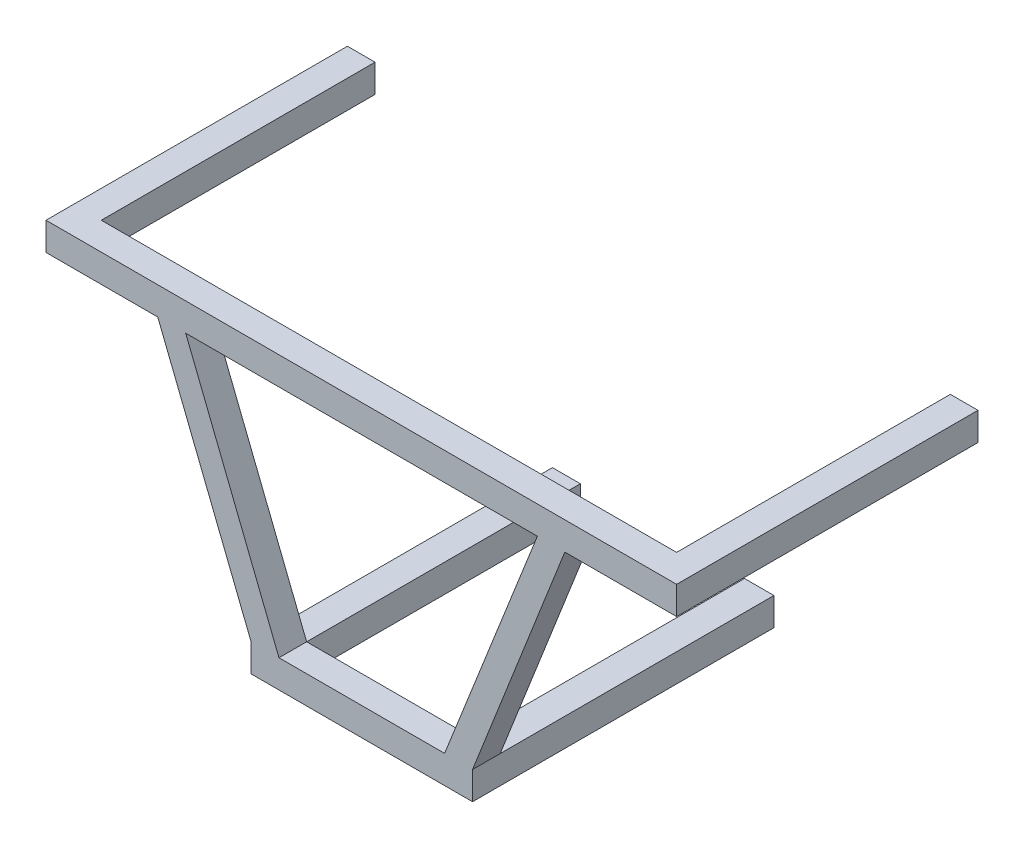
ISO-10303-21;
HEADER;
FILE_DESCRIPTION(('STEP AP214'),'2;1');
FILE_NAME('part.step','',(''),(''),'','','');
FILE_SCHEMA(('AUTOMOTIVE_DESIGN { 1 0 10303 214 1 1 1 1 }'));
ENDSEC;
DATA;
#1=APPLICATION_CONTEXT('core data for automotive mechanical design processes');
#2=APPLICATION_PROTOCOL_DEFINITION('international standard','automotive_design',2000,#1);
#3=PRODUCT_CONTEXT('',#1,'mechanical');
#4=PRODUCT('Part','Part','',(#3));
#5=PRODUCT_RELATED_PRODUCT_CATEGORY('part','',(#4));
#6=PRODUCT_DEFINITION_FORMATION('','',#4);
#7=PRODUCT_DEFINITION_CONTEXT('part definition',#1,'design');
#8=PRODUCT_DEFINITION('design','',#6,#7);
#9=PRODUCT_DEFINITION_SHAPE('','',#8);
#10=(LENGTH_UNIT() NAMED_UNIT(*) SI_UNIT(.MILLI.,.METRE.));
#11=(NAMED_UNIT(*) PLANE_ANGLE_UNIT() SI_UNIT($,.RADIAN.));
#12=(NAMED_UNIT(*) SI_UNIT($,.STERADIAN.) SOLID_ANGLE_UNIT());
#13=UNCERTAINTY_MEASURE_WITH_UNIT(LENGTH_MEASURE(1.E-05),#10,'distance_accuracy_value','');
#14=(GEOMETRIC_REPRESENTATION_CONTEXT(3) GLOBAL_UNCERTAINTY_ASSIGNED_CONTEXT((#13)) GLOBAL_UNIT_ASSIGNED_CONTEXT((#10,
#11,#12)) REPRESENTATION_CONTEXT('',''));
#15=CARTESIAN_POINT('',(0.,0.,0.));
#16=DIRECTION('',(0.,0.,1.));
#17=DIRECTION('',(1.,0.,0.));
#18=AXIS2_PLACEMENT_3D('',#15,#16,#17);
#19=CARTESIAN_POINT('',(1.17087409782305,-164.978418177507,0.));
#20=DIRECTION('',(0.,0.,1.));
#21=DIRECTION('',(1.,0.,0.));
#22=AXIS2_PLACEMENT_3D('',#19,#20,#21);
#23=PLANE('',#22);
#24=DIRECTION('',(1.,0.,0.));
#25=VECTOR('',#24,1.);
#26=CARTESIAN_POINT('',(1.17087409782305,-41.7659648432376,0.));
#27=LINE('',#26,#25);
#28=CARTESIAN_POINT('',(-29.7683982683984,-41.7659648432376,0.));
#29=VERTEX_POINT('',#28);
#30=CARTESIAN_POINT('',(29.588895343738,-41.7659648432376,0.));
#31=VERTEX_POINT('',#30);
#32=EDGE_CURVE('E309',#29,#31,#27,.T.);
#33=ORIENTED_EDGE('',*,*,#32,.T.);
#34=DIRECTION('',(0.,-1.,0.));
#35=VECTOR('',#34,1.);
#36=CARTESIAN_POINT('',(29.588895343738,-164.978418177507,0.));
#37=LINE('',#36,#35);
#38=CARTESIAN_POINT('',(29.588895343738,-51.869178800997,0.));
#39=VERTEX_POINT('',#38);
#40=EDGE_CURVE('E239',#31,#39,#37,.T.);
#41=ORIENTED_EDGE('',*,*,#40,.T.);
#42=DIRECTION('',(1.,0.,0.));
#43=VECTOR('',#42,1.);
#44=CARTESIAN_POINT('',(1.17087409782305,-51.869178800997,0.));
#45=LINE('',#44,#43);
#46=CARTESIAN_POINT('',(-29.7683982683984,-51.869178800997,0.));
#47=VERTEX_POINT('',#46);
#48=EDGE_CURVE('E314',#47,#39,#45,.T.);
#49=ORIENTED_EDGE('',*,*,#48,.F.);
#50=DIRECTION('',(0.,1.,0.));
#51=VECTOR('',#50,1.);
#52=CARTESIAN_POINT('',(-29.7683982683984,-164.978418177507,0.));
#53=LINE('',#52,#51);
#54=EDGE_CURVE('E256',#47,#29,#53,.T.);
#55=ORIENTED_EDGE('',*,*,#54,.T.);
#56=EDGE_LOOP('',(#33,#41,#49,#55));
#57=FACE_BOUND('',#56,.T.);
#58=ADVANCED_FACE('F31',(#57),#23,.F.);
#59=CARTESIAN_POINT('',(1.17087409782305,43.0288665879575,10.));
#60=DIRECTION('',(0.,1.,0.));
#61=DIRECTION('',(0.,0.,1.));
#62=AXIS2_PLACEMENT_3D('',#59,#60,#61);
#63=PLANE('',#62);
#64=DIRECTION('',(1.,0.,0.));
#65=VECTOR('',#64,1.);
#66=CARTESIAN_POINT('',(1.17087409782305,43.0288665879575,0.));
#67=LINE('',#66,#65);
#68=CARTESIAN_POINT('',(-63.5059163059163,43.0288665879575,0.));
#69=VERTEX_POINT('',#68);
#70=CARTESIAN_POINT('',(63.6863308408762,43.0288665879575,0.));
#71=VERTEX_POINT('',#70);
#72=EDGE_CURVE('E339',#69,#71,#67,.T.);
#73=ORIENTED_EDGE('',*,*,#72,.T.);
#74=DIRECTION('',(0.,0.,-1.));
#75=VECTOR('',#74,1.);
#76=CARTESIAN_POINT('',(63.6863308408762,43.0288665879575,10.));
#77=LINE('',#76,#75);
#78=CARTESIAN_POINT('',(63.6863308408762,43.0288665879575,10.));
#79=VERTEX_POINT('',#78);
#80=EDGE_CURVE('E296',#79,#71,#77,.T.);
#81=ORIENTED_EDGE('',*,*,#80,.F.);
#82=DIRECTION('',(1.,0.,0.));
#83=VECTOR('',#82,1.);
#84=CARTESIAN_POINT('',(1.17087409782305,43.0288665879575,10.));
#85=LINE('',#84,#83);
#86=CARTESIAN_POINT('',(-63.5059163059163,43.0288665879575,10.));
#87=VERTEX_POINT('',#86);
#88=EDGE_CURVE('E384',#87,#79,#85,.T.);
#89=ORIENTED_EDGE('',*,*,#88,.F.);
#90=DIRECTION('',(0.,0.,-1.));
#91=VECTOR('',#90,1.);
#92=CARTESIAN_POINT('',(-63.5059163059163,43.0288665879575,10.));
#93=LINE('',#92,#91);
#94=EDGE_CURVE('E358',#87,#69,#93,.T.);
#95=ORIENTED_EDGE('',*,*,#94,.T.);
#96=EDGE_LOOP('',(#73,#81,#89,#95));
#97=FACE_BOUND('',#96,.T.);
#98=ADVANCED_FACE('F415',(#97),#63,.F.);
#99=DIRECTION('',(0.,0.,-1.));
#100=VECTOR('',#99,1.);
#101=CARTESIAN_POINT('',(-73.6091302636757,43.0288665879575,10.));
#102=LINE('',#101,#100);
#103=CARTESIAN_POINT('',(-73.6091302636757,43.0288665879575,10.));
#104=VERTEX_POINT('',#103);
#105=CARTESIAN_POINT('',(-73.6091302636757,43.0288665879575,0.));
#106=VERTEX_POINT('',#105);
#107=EDGE_CURVE('E360',#104,#106,#102,.T.);
#108=ORIENTED_EDGE('',*,*,#107,.F.);
#109=CARTESIAN_POINT('',(-114.021986094713,43.0288665879575,10.));
#110=VERTEX_POINT('',#109);
#111=EDGE_CURVE('E385',#110,#104,#85,.T.);
#112=ORIENTED_EDGE('',*,*,#111,.F.);
#113=DIRECTION('',(0.,0.,-1.));
#114=VECTOR('',#113,1.);
#115=CARTESIAN_POINT('',(-114.021986094713,43.0288665879575,10.));
#116=LINE('',#115,#114);
#117=CARTESIAN_POINT('',(-114.021986094713,43.0288665879575,-99.));
#118=VERTEX_POINT('',#117);
#119=EDGE_CURVE('E390',#110,#118,#116,.T.);
#120=ORIENTED_EDGE('',*,*,#119,.T.);
#121=DIRECTION('',(1.,0.,0.));
#122=VECTOR('',#121,1.);
#123=CARTESIAN_POINT('',(-114.021986094713,43.0288665879575,-99.));
#124=LINE('',#123,#122);
#125=CARTESIAN_POINT('',(-104.023516638141,43.0288665879575,-99.));
#126=VERTEX_POINT('',#125);
#127=EDGE_CURVE('E275',#118,#126,#124,.T.);
#128=ORIENTED_EDGE('',*,*,#127,.T.);
#129=DIRECTION('',(0.,0.,1.));
#130=VECTOR('',#129,1.);
#131=CARTESIAN_POINT('',(-104.023516638141,43.0288665879575,-99.));
#132=LINE('',#131,#130);
#133=CARTESIAN_POINT('',(-104.023516638141,43.0288665879575,0.));
#134=VERTEX_POINT('',#133);
#135=EDGE_CURVE('E284',#126,#134,#132,.T.);
#136=ORIENTED_EDGE('',*,*,#135,.T.);
#137=EDGE_CURVE('E351',#134,#106,#67,.T.);
#138=ORIENTED_EDGE('',*,*,#137,.T.);
#139=EDGE_LOOP('',(#108,#112,#120,#128,#136,#138));
#140=FACE_BOUND('',#139,.T.);
#141=ADVANCED_FACE('F421',(#140),#63,.F.);
#142=CARTESIAN_POINT('',(114.021986094713,-164.978418177507,10.));
#143=DIRECTION('',(1.,0.,0.));
#144=DIRECTION('',(0.,0.,-1.));
#145=AXIS2_PLACEMENT_3D('',#142,#143,#144);
#146=PLANE('',#145);
#147=DIRECTION('',(0.,0.,-1.));
#148=VECTOR('',#147,1.);
#149=CARTESIAN_POINT('',(114.021986094713,43.0288665879575,10.));
#150=LINE('',#149,#148);
#151=CARTESIAN_POINT('',(114.021986094713,43.0288665879575,10.));
#152=VERTEX_POINT('',#151);
#153=CARTESIAN_POINT('',(114.021986094713,43.0288665879575,-99.));
#154=VERTEX_POINT('',#153);
#155=EDGE_CURVE('E204',#152,#154,#150,.T.);
#156=ORIENTED_EDGE('',*,*,#155,.T.);
#157=DIRECTION('',(0.,1.,0.));
#158=VECTOR('',#157,1.);
#159=CARTESIAN_POINT('',(114.021986094713,53.1320805457169,-99.));
#160=LINE('',#159,#158);
#161=CARTESIAN_POINT('',(114.021986094713,53.1320805457169,-99.));
#162=VERTEX_POINT('',#161);
#163=EDGE_CURVE('E198',#154,#162,#160,.T.);
#164=ORIENTED_EDGE('',*,*,#163,.T.);
#165=DIRECTION('',(0.,0.,-1.));
#166=VECTOR('',#165,1.);
#167=CARTESIAN_POINT('',(114.021986094713,53.1320805457169,10.));
#168=LINE('',#167,#166);
#169=CARTESIAN_POINT('',(114.021986094713,53.1320805457169,10.));
#170=VERTEX_POINT('',#169);
#171=EDGE_CURVE('E180',#170,#162,#168,.T.);
#172=ORIENTED_EDGE('',*,*,#171,.F.);
#173=DIRECTION('',(0.,-1.,0.));
#174=VECTOR('',#173,1.);
#175=CARTESIAN_POINT('',(114.021986094713,-164.978418177507,10.));
#176=LINE('',#175,#174);
#177=EDGE_CURVE('E352',#170,#152,#176,.T.);
#178=ORIENTED_EDGE('',*,*,#177,.T.);
#179=EDGE_LOOP('',(#156,#164,#172,#178));
#180=FACE_BOUND('',#179,.T.);
#181=ADVANCED_FACE('F33',(#180),#146,.T.);
#182=CARTESIAN_POINT('',(1.17087409782305,53.1320805457169,10.));
#183=DIRECTION('',(0.,1.,0.));
#184=DIRECTION('',(0.,0.,1.));
#185=AXIS2_PLACEMENT_3D('',#182,#183,#184);
#186=PLANE('',#185);
#187=DIRECTION('',(1.,0.,0.));
#188=VECTOR('',#187,1.);
#189=CARTESIAN_POINT('',(1.17087409782305,53.1320805457169,10.));
#190=LINE('',#189,#188);
#191=CARTESIAN_POINT('',(-114.021986094713,53.1320805457169,10.));
#192=VERTEX_POINT('',#191);
#193=EDGE_CURVE('E186',#192,#170,#190,.T.);
#194=ORIENTED_EDGE('',*,*,#193,.T.);
#195=ORIENTED_EDGE('',*,*,#171,.T.);
#196=DIRECTION('',(-1.,0.,0.));
#197=VECTOR('',#196,1.);
#198=CARTESIAN_POINT('',(114.021986094713,53.1320805457169,-99.));
#199=LINE('',#198,#197);
#200=CARTESIAN_POINT('',(104.023491638141,53.1320805457169,-99.));
#201=VERTEX_POINT('',#200);
#202=EDGE_CURVE('E184',#162,#201,#199,.T.);
#203=ORIENTED_EDGE('',*,*,#202,.T.);
#204=DIRECTION('',(0.,0.,1.));
#205=VECTOR('',#204,1.);
#206=CARTESIAN_POINT('',(104.023491638141,53.1320805457169,-99.));
#207=LINE('',#206,#205);
#208=CARTESIAN_POINT('',(104.023491638141,53.1320805457169,0.));
#209=VERTEX_POINT('',#208);
#210=EDGE_CURVE('E210',#201,#209,#207,.T.);
#211=ORIENTED_EDGE('',*,*,#210,.T.);
#212=DIRECTION('',(1.,0.,0.));
#213=VECTOR('',#212,1.);
#214=CARTESIAN_POINT('',(1.17087409782305,53.1320805457169,0.));
#215=LINE('',#214,#213);
#216=CARTESIAN_POINT('',(-104.023516638141,53.1320805457169,0.));
#217=VERTEX_POINT('',#216);
#218=EDGE_CURVE('E49',#217,#209,#215,.T.);
#219=ORIENTED_EDGE('',*,*,#218,.F.);
#220=DIRECTION('',(0.,0.,1.));
#221=VECTOR('',#220,1.);
#222=CARTESIAN_POINT('',(-104.023516638141,53.1320805457169,-99.));
#223=LINE('',#222,#221);
#224=CARTESIAN_POINT('',(-104.023516638141,53.1320805457169,-99.));
#225=VERTEX_POINT('',#224);
#226=EDGE_CURVE('E285',#225,#217,#223,.T.);
#227=ORIENTED_EDGE('',*,*,#226,.F.);
#228=DIRECTION('',(-1.,0.,0.));
#229=VECTOR('',#228,1.);
#230=CARTESIAN_POINT('',(-114.021986094713,53.1320805457169,-99.));
#231=LINE('',#230,#229);
#232=CARTESIAN_POINT('',(-114.021986094713,53.1320805457169,-99.));
#233=VERTEX_POINT('',#232);
#234=EDGE_CURVE('E281',#225,#233,#231,.T.);
#235=ORIENTED_EDGE('',*,*,#234,.T.);
#236=DIRECTION('',(0.,0.,-1.));
#237=VECTOR('',#236,1.);
#238=CARTESIAN_POINT('',(-114.021986094713,53.1320805457169,10.));
#239=LINE('',#238,#237);
#240=EDGE_CURVE('E191',#192,#233,#239,.T.);
#241=ORIENTED_EDGE('',*,*,#240,.F.);
#242=EDGE_LOOP('',(#194,#195,#203,#211,#219,#227,#235,#241));
#243=FACE_BOUND('',#242,.T.);
#244=ADVANCED_FACE('F182',(#243),#186,.T.);
#245=CARTESIAN_POINT('',(-114.021986094713,-164.978418177507,10.));
#246=DIRECTION('',(1.,0.,0.));
#247=DIRECTION('',(0.,0.,-1.));
#248=AXIS2_PLACEMENT_3D('',#245,#246,#247);
#249=PLANE('',#248);
#250=ORIENTED_EDGE('',*,*,#240,.T.);
#251=DIRECTION('',(0.,-1.,0.));
#252=VECTOR('',#251,1.);
#253=CARTESIAN_POINT('',(-114.021986094713,53.1320805457169,-99.));
#254=LINE('',#253,#252);
#255=EDGE_CURVE('E270',#233,#118,#254,.T.);
#256=ORIENTED_EDGE('',*,*,#255,.T.);
#257=ORIENTED_EDGE('',*,*,#119,.F.);
#258=DIRECTION('',(0.,-1.,0.));
#259=VECTOR('',#258,1.);
#260=CARTESIAN_POINT('',(-114.021986094713,-164.978418177507,10.));
#261=LINE('',#260,#259);
#262=EDGE_CURVE('E379',#192,#110,#261,.T.);
#263=ORIENTED_EDGE('',*,*,#262,.F.);
#264=EDGE_LOOP('',(#250,#256,#257,#263));
#265=FACE_BOUND('',#264,.T.);
#266=ADVANCED_FACE('F436',(#265),#249,.F.);
#267=CARTESIAN_POINT('',(73.6091302636757,43.0288665879575,0.));
#268=VERTEX_POINT('',#267);
#269=CARTESIAN_POINT('',(104.023491638141,43.0288665879575,0.));
#270=VERTEX_POINT('',#269);
#271=EDGE_CURVE('E336',#268,#270,#67,.T.);
#272=ORIENTED_EDGE('',*,*,#271,.T.);
#273=DIRECTION('',(0.,0.,1.));
#274=VECTOR('',#273,1.);
#275=CARTESIAN_POINT('',(104.023491638141,43.0288665879575,-99.));
#276=LINE('',#275,#274);
#277=CARTESIAN_POINT('',(104.023491638141,43.0288665879575,-99.));
#278=VERTEX_POINT('',#277);
#279=EDGE_CURVE('E211',#278,#270,#276,.T.);
#280=ORIENTED_EDGE('',*,*,#279,.F.);
#281=DIRECTION('',(1.,0.,0.));
#282=VECTOR('',#281,1.);
#283=CARTESIAN_POINT('',(114.021986094713,43.0288665879575,-99.));
#284=LINE('',#283,#282);
#285=EDGE_CURVE('E208',#278,#154,#284,.T.);
#286=ORIENTED_EDGE('',*,*,#285,.T.);
#287=ORIENTED_EDGE('',*,*,#155,.F.);
#288=CARTESIAN_POINT('',(73.6091302636757,43.0288665879575,10.));
#289=VERTEX_POINT('',#288);
#290=EDGE_CURVE('E340',#289,#152,#85,.T.);
#291=ORIENTED_EDGE('',*,*,#290,.F.);
#292=DIRECTION('',(0.,0.,-1.));
#293=VECTOR('',#292,1.);
#294=CARTESIAN_POINT('',(73.6091302636757,43.0288665879575,10.));
#295=LINE('',#294,#293);
#296=EDGE_CURVE('E303',#289,#268,#295,.T.);
#297=ORIENTED_EDGE('',*,*,#296,.T.);
#298=EDGE_LOOP('',(#272,#280,#286,#287,#291,#297));
#299=FACE_BOUND('',#298,.T.);
#300=ADVANCED_FACE('F400',(#299),#63,.F.);
#301=CARTESIAN_POINT('',(1.17087409782305,-164.978418177507,10.));
#302=DIRECTION('',(0.,0.,1.));
#303=DIRECTION('',(1.,0.,0.));
#304=AXIS2_PLACEMENT_3D('',#301,#302,#303);
#305=PLANE('',#304);
#306=ORIENTED_EDGE('',*,*,#290,.T.);
#307=ORIENTED_EDGE('',*,*,#177,.F.);
#308=ORIENTED_EDGE('',*,*,#193,.F.);
#309=ORIENTED_EDGE('',*,*,#262,.T.);
#310=ORIENTED_EDGE('',*,*,#111,.T.);
#311=DIRECTION('',(-0.36968580121388,0.929156826580342,0.));
#312=VECTOR('',#311,1.);
#313=CARTESIAN_POINT('',(8.06056098674495,-162.237202330212,10.));
#314=LINE('',#313,#312);
#315=CARTESIAN_POINT('',(-39.8716122261577,-41.7659648432376,10.));
#316=VERTEX_POINT('',#315);
#317=EDGE_CURVE('E333',#316,#104,#314,.T.);
#318=ORIENTED_EDGE('',*,*,#317,.F.);
#319=DIRECTION('',(0.,-1.,0.));
#320=VECTOR('',#319,1.);
#321=CARTESIAN_POINT('',(-39.8716122261577,-164.978418177507,10.));
#322=LINE('',#321,#320);
#323=CARTESIAN_POINT('',(-39.8716122261577,-51.869178800997,10.));
#324=VERTEX_POINT('',#323);
#325=EDGE_CURVE('E317',#316,#324,#322,.T.);
#326=ORIENTED_EDGE('',*,*,#325,.T.);
#327=DIRECTION('',(1.,0.,0.));
#328=VECTOR('',#327,1.);
#329=CARTESIAN_POINT('',(1.17087409782305,-51.869178800997,10.));
#330=LINE('',#329,#328);
#331=CARTESIAN_POINT('',(40.2324412960777,-51.869178800997,10.));
#332=VERTEX_POINT('',#331);
#333=EDGE_CURVE('E501',#324,#332,#330,.T.);
#334=ORIENTED_EDGE('',*,*,#333,.T.);
#335=DIRECTION('',(0.,-1.,0.));
#336=VECTOR('',#335,1.);
#337=CARTESIAN_POINT('',(40.2324412960777,-164.978418177507,10.));
#338=LINE('',#337,#336);
#339=CARTESIAN_POINT('',(40.2324412960777,-41.7659648432376,10.));
#340=VERTEX_POINT('',#339);
#341=EDGE_CURVE('E310',#340,#332,#338,.T.);
#342=ORIENTED_EDGE('',*,*,#341,.F.);
#343=DIRECTION('',(-0.366264831108058,-0.930510652004256,0.));
#344=VECTOR('',#343,1.);
#345=CARTESIAN_POINT('',(-7.00011119691586,-161.762179284897,10.));
#346=LINE('',#345,#344);
#347=EDGE_CURVE('E292',#289,#340,#346,.T.);
#348=ORIENTED_EDGE('',*,*,#347,.F.);
#349=EDGE_LOOP('',(#306,#307,#308,#309,#310,#318,#326,#334,#342,#348));
#350=FACE_BOUND('',#349,.T.);
#351=DIRECTION('',(0.36797718399465,0.92983481977143,0.));
#352=VECTOR('',#351,1.);
#353=CARTESIAN_POINT('',(-15.9500688510154,-158.202896074349,10.));
#354=LINE('',#353,#352);
#355=CARTESIAN_POINT('',(30.1292273383182,-41.7659648432376,10.));
#356=VERTEX_POINT('',#355);
#357=EDGE_CURVE('E289',#356,#79,#354,.T.);
#358=ORIENTED_EDGE('',*,*,#357,.F.);
#359=DIRECTION('',(1.,0.,0.));
#360=VECTOR('',#359,1.);
#361=CARTESIAN_POINT('',(1.17087409782305,-41.7659648432376,10.));
#362=LINE('',#361,#360);
#363=CARTESIAN_POINT('',(-29.7683982683984,-41.7659648432376,10.));
#364=VERTEX_POINT('',#363);
#365=EDGE_CURVE('E313',#364,#356,#362,.T.);
#366=ORIENTED_EDGE('',*,*,#365,.F.);
#367=DIRECTION('',(0.36968580121388,-0.929156826580342,0.));
#368=VECTOR('',#367,1.);
#369=CARTESIAN_POINT('',(16.7829930252843,-158.766787880836,10.));
#370=LINE('',#369,#368);
#371=EDGE_CURVE('E372',#87,#364,#370,.T.);
#372=ORIENTED_EDGE('',*,*,#371,.F.);
#373=ORIENTED_EDGE('',*,*,#88,.T.);
#374=EDGE_LOOP('',(#358,#366,#372,#373));
#375=FACE_BOUND('',#374,.T.);
#376=ADVANCED_FACE('F396',(#350,#375),#305,.T.);
#377=ORIENTED_EDGE('',*,*,#218,.T.);
#378=DIRECTION('',(0.,-1.,0.));
#379=VECTOR('',#378,1.);
#380=CARTESIAN_POINT('',(104.023491638141,-164.978418177507,0.));
#381=LINE('',#380,#379);
#382=EDGE_CURVE('E11',#209,#270,#381,.T.);
#383=ORIENTED_EDGE('',*,*,#382,.T.);
#384=ORIENTED_EDGE('',*,*,#271,.F.);
#385=DIRECTION('',(-0.366264831108058,-0.930510652004256,0.));
#386=VECTOR('',#385,1.);
#387=CARTESIAN_POINT('',(-7.00011119691586,-161.762179284897,0.));
#388=LINE('',#387,#386);
#389=CARTESIAN_POINT('',(40.2324412960777,-41.7659648432376,0.));
#390=VERTEX_POINT('',#389);
#391=EDGE_CURVE('E293',#268,#390,#388,.T.);
#392=ORIENTED_EDGE('',*,*,#391,.T.);
#393=DIRECTION('',(-1.,0.,0.));
#394=VECTOR('',#393,1.);
#395=CARTESIAN_POINT('',(1.17087409782305,-41.7659648432376,0.));
#396=LINE('',#395,#394);
#397=CARTESIAN_POINT('',(30.1292273383182,-41.7659648432376,0.));
#398=VERTEX_POINT('',#397);
#399=EDGE_CURVE('E231',#390,#398,#396,.T.);
#400=ORIENTED_EDGE('',*,*,#399,.T.);
#401=DIRECTION('',(0.36797718399465,0.92983481977143,0.));
#402=VECTOR('',#401,1.);
#403=CARTESIAN_POINT('',(-15.9500688510154,-158.202896074349,0.));
#404=LINE('',#403,#402);
#405=EDGE_CURVE('E287',#398,#71,#404,.T.);
#406=ORIENTED_EDGE('',*,*,#405,.T.);
#407=ORIENTED_EDGE('',*,*,#72,.F.);
#408=DIRECTION('',(0.36968580121388,-0.929156826580342,0.));
#409=VECTOR('',#408,1.);
#410=CARTESIAN_POINT('',(16.7829930252843,-158.766787880836,0.));
#411=LINE('',#410,#409);
#412=EDGE_CURVE('E506',#69,#29,#411,.T.);
#413=ORIENTED_EDGE('',*,*,#412,.T.);
#414=DIRECTION('',(-1.,0.,0.));
#415=VECTOR('',#414,1.);
#416=CARTESIAN_POINT('',(1.17087409782305,-41.7659648432376,0.));
#417=LINE('',#416,#415);
#418=CARTESIAN_POINT('',(-39.8716122261577,-41.7659648432376,0.));
#419=VERTEX_POINT('',#418);
#420=EDGE_CURVE('E265',#29,#419,#417,.T.);
#421=ORIENTED_EDGE('',*,*,#420,.T.);
#422=DIRECTION('',(-0.36968580121388,0.929156826580342,0.));
#423=VECTOR('',#422,1.);
#424=CARTESIAN_POINT('',(8.06056098674495,-162.237202330212,0.));
#425=LINE('',#424,#423);
#426=EDGE_CURVE('E509',#419,#106,#425,.T.);
#427=ORIENTED_EDGE('',*,*,#426,.T.);
#428=ORIENTED_EDGE('',*,*,#137,.F.);
#429=DIRECTION('',(0.,1.,0.));
#430=VECTOR('',#429,1.);
#431=CARTESIAN_POINT('',(-104.023516638141,-164.978418177507,0.));
#432=LINE('',#431,#430);
#433=EDGE_CURVE('E39',#134,#217,#432,.T.);
#434=ORIENTED_EDGE('',*,*,#433,.T.);
#435=EDGE_LOOP('',(#377,#383,#384,#392,#400,#406,#407,#413,#421,#427,#428,#434));
#436=FACE_BOUND('',#435,.T.);
#437=ADVANCED_FACE('F355',(#436),#23,.F.);
#438=CARTESIAN_POINT('',(16.7829930252843,-158.766787880836,10.));
#439=DIRECTION('',(0.929156826580342,0.36968580121388,0.));
#440=DIRECTION('',(-0.36968580121388,0.929156826580342,0.));
#441=AXIS2_PLACEMENT_3D('',#438,#439,#440);
#442=PLANE('',#441);
#443=ORIENTED_EDGE('',*,*,#412,.F.);
#444=ORIENTED_EDGE('',*,*,#94,.F.);
#445=ORIENTED_EDGE('',*,*,#371,.T.);
#446=DIRECTION('',(0.,0.,-1.));
#447=VECTOR('',#446,1.);
#448=CARTESIAN_POINT('',(-29.7683982683984,-41.7659648432376,10.));
#449=LINE('',#448,#447);
#450=EDGE_CURVE('E329',#364,#29,#449,.T.);
#451=ORIENTED_EDGE('',*,*,#450,.T.);
#452=EDGE_LOOP('',(#443,#444,#445,#451));
#453=FACE_BOUND('',#452,.T.);
#454=ADVANCED_FACE('F425',(#453),#442,.T.);
#455=CARTESIAN_POINT('',(8.06056098674495,-162.237202330212,10.));
#456=DIRECTION('',(-0.929156826580342,-0.36968580121388,0.));
#457=DIRECTION('',(0.36968580121388,-0.929156826580342,0.));
#458=AXIS2_PLACEMENT_3D('',#455,#456,#457);
#459=PLANE('',#458);
#460=ORIENTED_EDGE('',*,*,#426,.F.);
#461=DIRECTION('',(0.,0.,-1.));
#462=VECTOR('',#461,1.);
#463=CARTESIAN_POINT('',(-39.8716122261577,-41.7659648432376,10.));
#464=LINE('',#463,#462);
#465=EDGE_CURVE('E326',#316,#419,#464,.T.);
#466=ORIENTED_EDGE('',*,*,#465,.F.);
#467=ORIENTED_EDGE('',*,*,#317,.T.);
#468=ORIENTED_EDGE('',*,*,#107,.T.);
#469=EDGE_LOOP('',(#460,#466,#467,#468));
#470=FACE_BOUND('',#469,.T.);
#471=ADVANCED_FACE('F430',(#470),#459,.T.);
#472=CARTESIAN_POINT('',(1.17087409782305,-41.7659648432376,10.));
#473=DIRECTION('',(0.,1.,0.));
#474=DIRECTION('',(0.,0.,1.));
#475=AXIS2_PLACEMENT_3D('',#472,#473,#474);
#476=PLANE('',#475);
#477=ORIENTED_EDGE('',*,*,#365,.T.);
#478=DIRECTION('',(0.,0.,-1.));
#479=VECTOR('',#478,1.);
#480=CARTESIAN_POINT('',(30.1292273383182,-41.7659648432376,10.));
#481=LINE('',#480,#479);
#482=EDGE_CURVE('E306',#356,#398,#481,.T.);
#483=ORIENTED_EDGE('',*,*,#482,.T.);
#484=ORIENTED_EDGE('',*,*,#399,.F.);
#485=DIRECTION('',(0.,0.,1.));
#486=VECTOR('',#485,1.);
#487=CARTESIAN_POINT('',(40.2324412960777,-41.7659648432376,-99.));
#488=LINE('',#487,#486);
#489=CARTESIAN_POINT('',(40.2324412960777,-41.7659648432376,-99.));
#490=VERTEX_POINT('',#489);
#491=EDGE_CURVE('E227',#490,#390,#488,.T.);
#492=ORIENTED_EDGE('',*,*,#491,.F.);
#493=DIRECTION('',(-1.,0.,0.));
#494=VECTOR('',#493,1.);
#495=CARTESIAN_POINT('',(40.2324412960777,-41.7659648432376,-99.));
#496=LINE('',#495,#494);
#497=CARTESIAN_POINT('',(29.588895343738,-41.7659648432376,-99.));
#498=VERTEX_POINT('',#497);
#499=EDGE_CURVE('E218',#490,#498,#496,.T.);
#500=ORIENTED_EDGE('',*,*,#499,.T.);
#501=DIRECTION('',(0.,0.,1.));
#502=VECTOR('',#501,1.);
#503=CARTESIAN_POINT('',(29.588895343738,-41.7659648432376,-99.));
#504=LINE('',#503,#502);
#505=EDGE_CURVE('E232',#498,#31,#504,.T.);
#506=ORIENTED_EDGE('',*,*,#505,.T.);
#507=ORIENTED_EDGE('',*,*,#32,.F.);
#508=ORIENTED_EDGE('',*,*,#450,.F.);
#509=EDGE_LOOP('',(#477,#483,#484,#492,#500,#506,#507,#508));
#510=FACE_BOUND('',#509,.T.);
#511=ADVANCED_FACE('F440',(#510),#476,.T.);
#512=CARTESIAN_POINT('',(40.2324412960777,-164.978418177507,10.));
#513=DIRECTION('',(1.,0.,0.));
#514=DIRECTION('',(0.,0.,-1.));
#515=AXIS2_PLACEMENT_3D('',#512,#513,#514);
#516=PLANE('',#515);
#517=DIRECTION('',(0.,0.,-1.));
#518=VECTOR('',#517,1.);
#519=CARTESIAN_POINT('',(40.2324412960777,-51.869178800997,10.));
#520=LINE('',#519,#518);
#521=CARTESIAN_POINT('',(40.2324412960777,-51.869178800997,-99.));
#522=VERTEX_POINT('',#521);
#523=EDGE_CURVE('E498',#332,#522,#520,.T.);
#524=ORIENTED_EDGE('',*,*,#523,.T.);
#525=DIRECTION('',(0.,1.,0.));
#526=VECTOR('',#525,1.);
#527=CARTESIAN_POINT('',(40.2324412960777,-41.7659648432376,-99.));
#528=LINE('',#527,#526);
#529=EDGE_CURVE('E214',#522,#490,#528,.T.);
#530=ORIENTED_EDGE('',*,*,#529,.T.);
#531=ORIENTED_EDGE('',*,*,#491,.T.);
#532=DIRECTION('',(0.,0.,-1.));
#533=VECTOR('',#532,1.);
#534=CARTESIAN_POINT('',(40.2324412960777,-41.7659648432376,10.));
#535=LINE('',#534,#533);
#536=EDGE_CURVE('E503',#340,#390,#535,.T.);
#537=ORIENTED_EDGE('',*,*,#536,.F.);
#538=ORIENTED_EDGE('',*,*,#341,.T.);
#539=EDGE_LOOP('',(#524,#530,#531,#537,#538));
#540=FACE_BOUND('',#539,.T.);
#541=ADVANCED_FACE('F442',(#540),#516,.T.);
#542=CARTESIAN_POINT('',(-39.8716122261577,-164.978418177507,10.));
#543=DIRECTION('',(1.,0.,0.));
#544=DIRECTION('',(0.,0.,-1.));
#545=AXIS2_PLACEMENT_3D('',#542,#543,#544);
#546=PLANE('',#545);
#547=ORIENTED_EDGE('',*,*,#465,.T.);
#548=DIRECTION('',(0.,0.,1.));
#549=VECTOR('',#548,1.);
#550=CARTESIAN_POINT('',(-39.8716122261577,-41.7659648432376,-99.));
#551=LINE('',#550,#549);
#552=CARTESIAN_POINT('',(-39.8716122261577,-41.7659648432376,-99.));
#553=VERTEX_POINT('',#552);
#554=EDGE_CURVE('E254',#553,#419,#551,.T.);
#555=ORIENTED_EDGE('',*,*,#554,.F.);
#556=DIRECTION('',(0.,-1.,0.));
#557=VECTOR('',#556,1.);
#558=CARTESIAN_POINT('',(-39.8716122261577,-41.7659648432376,-99.));
#559=LINE('',#558,#557);
#560=CARTESIAN_POINT('',(-39.8716122261577,-51.869178800997,-99.));
#561=VERTEX_POINT('',#560);
#562=EDGE_CURVE('E241',#553,#561,#559,.T.);
#563=ORIENTED_EDGE('',*,*,#562,.T.);
#564=DIRECTION('',(0.,0.,-1.));
#565=VECTOR('',#564,1.);
#566=CARTESIAN_POINT('',(-39.8716122261577,-51.869178800997,10.));
#567=LINE('',#566,#565);
#568=EDGE_CURVE('E500',#324,#561,#567,.T.);
#569=ORIENTED_EDGE('',*,*,#568,.F.);
#570=ORIENTED_EDGE('',*,*,#325,.F.);
#571=EDGE_LOOP('',(#547,#555,#563,#569,#570));
#572=FACE_BOUND('',#571,.T.);
#573=ADVANCED_FACE('F445',(#572),#546,.F.);
#574=CARTESIAN_POINT('',(1.17087409782305,-51.869178800997,10.));
#575=DIRECTION('',(0.,1.,0.));
#576=DIRECTION('',(0.,0.,1.));
#577=AXIS2_PLACEMENT_3D('',#574,#575,#576);
#578=PLANE('',#577);
#579=ORIENTED_EDGE('',*,*,#48,.T.);
#580=DIRECTION('',(0.,0.,1.));
#581=VECTOR('',#580,1.);
#582=CARTESIAN_POINT('',(29.588895343738,-51.869178800997,-99.));
#583=LINE('',#582,#581);
#584=CARTESIAN_POINT('',(29.588895343738,-51.869178800997,-99.));
#585=VERTEX_POINT('',#584);
#586=EDGE_CURVE('E228',#585,#39,#583,.T.);
#587=ORIENTED_EDGE('',*,*,#586,.F.);
#588=DIRECTION('',(1.,0.,0.));
#589=VECTOR('',#588,1.);
#590=CARTESIAN_POINT('',(40.2324412960777,-51.869178800997,-99.));
#591=LINE('',#590,#589);
#592=EDGE_CURVE('E224',#585,#522,#591,.T.);
#593=ORIENTED_EDGE('',*,*,#592,.T.);
#594=ORIENTED_EDGE('',*,*,#523,.F.);
#595=ORIENTED_EDGE('',*,*,#333,.F.);
#596=ORIENTED_EDGE('',*,*,#568,.T.);
#597=DIRECTION('',(1.,0.,0.));
#598=VECTOR('',#597,1.);
#599=CARTESIAN_POINT('',(-39.8716122261577,-51.869178800997,-99.));
#600=LINE('',#599,#598);
#601=CARTESIAN_POINT('',(-29.7683982683984,-51.869178800997,-99.));
#602=VERTEX_POINT('',#601);
#603=EDGE_CURVE('E244',#561,#602,#600,.T.);
#604=ORIENTED_EDGE('',*,*,#603,.T.);
#605=DIRECTION('',(0.,0.,1.));
#606=VECTOR('',#605,1.);
#607=CARTESIAN_POINT('',(-29.7683982683984,-51.869178800997,-99.));
#608=LINE('',#607,#606);
#609=EDGE_CURVE('E253',#602,#47,#608,.T.);
#610=ORIENTED_EDGE('',*,*,#609,.T.);
#611=EDGE_LOOP('',(#579,#587,#593,#594,#595,#596,#604,#610));
#612=FACE_BOUND('',#611,.T.);
#613=ADVANCED_FACE('F452',(#612),#578,.F.);
#614=CARTESIAN_POINT('',(-15.9500688510154,-158.202896074349,10.));
#615=DIRECTION('',(-0.92983481977143,0.36797718399465,0.));
#616=DIRECTION('',(-0.36797718399465,-0.92983481977143,0.));
#617=AXIS2_PLACEMENT_3D('',#614,#615,#616);
#618=PLANE('',#617);
#619=ORIENTED_EDGE('',*,*,#405,.F.);
#620=ORIENTED_EDGE('',*,*,#482,.F.);
#621=ORIENTED_EDGE('',*,*,#357,.T.);
#622=ORIENTED_EDGE('',*,*,#80,.T.);
#623=EDGE_LOOP('',(#619,#620,#621,#622));
#624=FACE_BOUND('',#623,.T.);
#625=ADVANCED_FACE('F456',(#624),#618,.T.);
#626=CARTESIAN_POINT('',(-7.00011119691586,-161.762179284897,10.));
#627=DIRECTION('',(0.930510652004256,-0.366264831108058,0.));
#628=DIRECTION('',(0.366264831108058,0.930510652004256,0.));
#629=AXIS2_PLACEMENT_3D('',#626,#627,#628);
#630=PLANE('',#629);
#631=ORIENTED_EDGE('',*,*,#391,.F.);
#632=ORIENTED_EDGE('',*,*,#296,.F.);
#633=ORIENTED_EDGE('',*,*,#347,.T.);
#634=ORIENTED_EDGE('',*,*,#536,.T.);
#635=EDGE_LOOP('',(#631,#632,#633,#634));
#636=FACE_BOUND('',#635,.T.);
#637=ADVANCED_FACE('F460',(#636),#630,.T.);
#638=CARTESIAN_POINT('',(-104.023516638141,53.1320805457169,-99.));
#639=DIRECTION('',(1.,0.,0.));
#640=DIRECTION('',(0.,0.,-1.));
#641=AXIS2_PLACEMENT_3D('',#638,#639,#640);
#642=PLANE('',#641);
#643=ORIENTED_EDGE('',*,*,#433,.F.);
#644=ORIENTED_EDGE('',*,*,#135,.F.);
#645=DIRECTION('',(0.,1.,0.));
#646=VECTOR('',#645,1.);
#647=CARTESIAN_POINT('',(-104.023516638141,53.1320805457169,-99.));
#648=LINE('',#647,#646);
#649=EDGE_CURVE('E278',#126,#225,#648,.T.);
#650=ORIENTED_EDGE('',*,*,#649,.T.);
#651=ORIENTED_EDGE('',*,*,#226,.T.);
#652=EDGE_LOOP('',(#643,#644,#650,#651));
#653=FACE_BOUND('',#652,.T.);
#654=ADVANCED_FACE('F464',(#653),#642,.T.);
#655=CARTESIAN_POINT('',(-114.021986094713,43.0288665879575,-99.));
#656=DIRECTION('',(0.,0.,1.));
#657=DIRECTION('',(1.,0.,0.));
#658=AXIS2_PLACEMENT_3D('',#655,#656,#657);
#659=PLANE('',#658);
#660=ORIENTED_EDGE('',*,*,#255,.F.);
#661=ORIENTED_EDGE('',*,*,#234,.F.);
#662=ORIENTED_EDGE('',*,*,#649,.F.);
#663=ORIENTED_EDGE('',*,*,#127,.F.);
#664=EDGE_LOOP('',(#660,#661,#662,#663));
#665=FACE_BOUND('',#664,.T.);
#666=ADVANCED_FACE('F468',(#665),#659,.F.);
#667=CARTESIAN_POINT('',(-39.8716122261577,-41.7659648432376,-99.));
#668=DIRECTION('',(0.,1.,0.));
#669=DIRECTION('',(0.,0.,1.));
#670=AXIS2_PLACEMENT_3D('',#667,#668,#669);
#671=PLANE('',#670);
#672=ORIENTED_EDGE('',*,*,#420,.F.);
#673=DIRECTION('',(0.,0.,1.));
#674=VECTOR('',#673,1.);
#675=CARTESIAN_POINT('',(-29.7683982683984,-41.7659648432376,-99.));
#676=LINE('',#675,#674);
#677=CARTESIAN_POINT('',(-29.7683982683984,-41.7659648432376,-99.));
#678=VERTEX_POINT('',#677);
#679=EDGE_CURVE('E257',#678,#29,#676,.T.);
#680=ORIENTED_EDGE('',*,*,#679,.F.);
#681=DIRECTION('',(-1.,0.,0.));
#682=VECTOR('',#681,1.);
#683=CARTESIAN_POINT('',(-39.8716122261577,-41.7659648432376,-99.));
#684=LINE('',#683,#682);
#685=EDGE_CURVE('E250',#678,#553,#684,.T.);
#686=ORIENTED_EDGE('',*,*,#685,.T.);
#687=ORIENTED_EDGE('',*,*,#554,.T.);
#688=EDGE_LOOP('',(#672,#680,#686,#687));
#689=FACE_BOUND('',#688,.T.);
#690=ADVANCED_FACE('F471',(#689),#671,.T.);
#691=CARTESIAN_POINT('',(-29.7683982683984,-41.7659648432376,-99.));
#692=DIRECTION('',(1.,0.,0.));
#693=DIRECTION('',(0.,0.,-1.));
#694=AXIS2_PLACEMENT_3D('',#691,#692,#693);
#695=PLANE('',#694);
#696=ORIENTED_EDGE('',*,*,#54,.F.);
#697=ORIENTED_EDGE('',*,*,#609,.F.);
#698=DIRECTION('',(0.,1.,0.));
#699=VECTOR('',#698,1.);
#700=CARTESIAN_POINT('',(-29.7683982683984,-41.7659648432376,-99.));
#701=LINE('',#700,#699);
#702=EDGE_CURVE('E247',#602,#678,#701,.T.);
#703=ORIENTED_EDGE('',*,*,#702,.T.);
#704=ORIENTED_EDGE('',*,*,#679,.T.);
#705=EDGE_LOOP('',(#696,#697,#703,#704));
#706=FACE_BOUND('',#705,.T.);
#707=ADVANCED_FACE('F473',(#706),#695,.T.);
#708=CARTESIAN_POINT('',(-39.8716122261577,-51.869178800997,-99.));
#709=DIRECTION('',(0.,0.,1.));
#710=DIRECTION('',(1.,0.,0.));
#711=AXIS2_PLACEMENT_3D('',#708,#709,#710);
#712=PLANE('',#711);
#713=ORIENTED_EDGE('',*,*,#562,.F.);
#714=ORIENTED_EDGE('',*,*,#685,.F.);
#715=ORIENTED_EDGE('',*,*,#702,.F.);
#716=ORIENTED_EDGE('',*,*,#603,.F.);
#717=EDGE_LOOP('',(#713,#714,#715,#716));
#718=FACE_BOUND('',#717,.T.);
#719=ADVANCED_FACE('F476',(#718),#712,.F.);
#720=CARTESIAN_POINT('',(29.588895343738,-41.7659648432376,-99.));
#721=DIRECTION('',(-1.,0.,0.));
#722=DIRECTION('',(0.,0.,1.));
#723=AXIS2_PLACEMENT_3D('',#720,#721,#722);
#724=PLANE('',#723);
#725=ORIENTED_EDGE('',*,*,#40,.F.);
#726=ORIENTED_EDGE('',*,*,#505,.F.);
#727=DIRECTION('',(0.,-1.,0.));
#728=VECTOR('',#727,1.);
#729=CARTESIAN_POINT('',(29.588895343738,-41.7659648432376,-99.));
#730=LINE('',#729,#728);
#731=EDGE_CURVE('E221',#498,#585,#730,.T.);
#732=ORIENTED_EDGE('',*,*,#731,.T.);
#733=ORIENTED_EDGE('',*,*,#586,.T.);
#734=EDGE_LOOP('',(#725,#726,#732,#733));
#735=FACE_BOUND('',#734,.T.);
#736=ADVANCED_FACE('F411',(#735),#724,.T.);
#737=CARTESIAN_POINT('',(40.2324412960777,-51.869178800997,-99.));
#738=DIRECTION('',(0.,0.,-1.));
#739=DIRECTION('',(-1.,0.,0.));
#740=AXIS2_PLACEMENT_3D('',#737,#738,#739);
#741=PLANE('',#740);
#742=ORIENTED_EDGE('',*,*,#529,.F.);
#743=ORIENTED_EDGE('',*,*,#592,.F.);
#744=ORIENTED_EDGE('',*,*,#731,.F.);
#745=ORIENTED_EDGE('',*,*,#499,.F.);
#746=EDGE_LOOP('',(#742,#743,#744,#745));
#747=FACE_BOUND('',#746,.T.);
#748=ADVANCED_FACE('F404',(#747),#741,.T.);
#749=CARTESIAN_POINT('',(104.023491638141,53.1320805457169,-99.));
#750=DIRECTION('',(-1.,0.,0.));
#751=DIRECTION('',(0.,0.,1.));
#752=AXIS2_PLACEMENT_3D('',#749,#750,#751);
#753=PLANE('',#752);
#754=ORIENTED_EDGE('',*,*,#382,.F.);
#755=ORIENTED_EDGE('',*,*,#210,.F.);
#756=DIRECTION('',(0.,-1.,0.));
#757=VECTOR('',#756,1.);
#758=CARTESIAN_POINT('',(104.023491638141,53.1320805457169,-99.));
#759=LINE('',#758,#757);
#760=EDGE_CURVE('E201',#201,#278,#759,.T.);
#761=ORIENTED_EDGE('',*,*,#760,.T.);
#762=ORIENTED_EDGE('',*,*,#279,.T.);
#763=EDGE_LOOP('',(#754,#755,#761,#762));
#764=FACE_BOUND('',#763,.T.);
#765=ADVANCED_FACE('F402',(#764),#753,.T.);
#766=CARTESIAN_POINT('',(114.021986094713,43.0288665879575,-99.));
#767=DIRECTION('',(0.,0.,-1.));
#768=DIRECTION('',(-1.,0.,0.));
#769=AXIS2_PLACEMENT_3D('',#766,#767,#768);
#770=PLANE('',#769);
#771=ORIENTED_EDGE('',*,*,#163,.F.);
#772=ORIENTED_EDGE('',*,*,#285,.F.);
#773=ORIENTED_EDGE('',*,*,#760,.F.);
#774=ORIENTED_EDGE('',*,*,#202,.F.);
#775=EDGE_LOOP('',(#771,#772,#773,#774));
#776=FACE_BOUND('',#775,.T.);
#777=ADVANCED_FACE('F196',(#776),#770,.T.);
#778=CLOSED_SHELL('',(#58,#98,#141,#181,#244,#266,#300,#376,#437,#454,#471,#511,#541,#573,#613,
#625,#637,#654,#666,#690,#707,#719,#736,#748,#765,#777));
#779=MANIFOLD_SOLID_BREP('B2',#778);
#780=ADVANCED_BREP_SHAPE_REPRESENTATION('',(#18,#779),#14);
#781=SHAPE_DEFINITION_REPRESENTATION(#9,#780);
ENDSEC;
END-ISO-10303-21;
